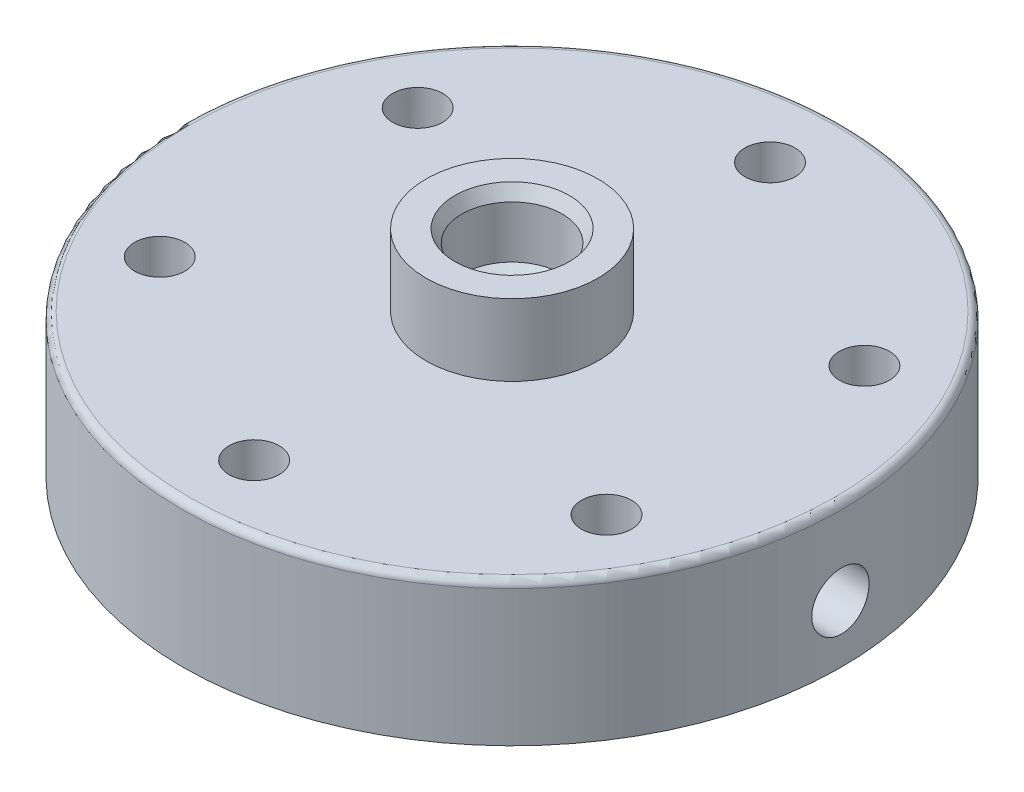
ISO-10303-21;
HEADER;
FILE_DESCRIPTION(('STEP AP214'),'2;1');
FILE_NAME('part.step','',(''),(''),'','','');
FILE_SCHEMA(('AUTOMOTIVE_DESIGN { 1 0 10303 214 1 1 1 1 }'));
ENDSEC;
DATA;
#1=APPLICATION_CONTEXT('core data for automotive mechanical design processes');
#2=APPLICATION_PROTOCOL_DEFINITION('international standard','automotive_design',2000,#1);
#3=PRODUCT_CONTEXT('',#1,'mechanical');
#4=PRODUCT('Part','Part','',(#3));
#5=PRODUCT_RELATED_PRODUCT_CATEGORY('part','',(#4));
#6=PRODUCT_DEFINITION_FORMATION('','',#4);
#7=PRODUCT_DEFINITION_CONTEXT('part definition',#1,'design');
#8=PRODUCT_DEFINITION('design','',#6,#7);
#9=PRODUCT_DEFINITION_SHAPE('','',#8);
#10=(LENGTH_UNIT() NAMED_UNIT(*) SI_UNIT(.MILLI.,.METRE.));
#11=(NAMED_UNIT(*) PLANE_ANGLE_UNIT() SI_UNIT($,.RADIAN.));
#12=(NAMED_UNIT(*) SI_UNIT($,.STERADIAN.) SOLID_ANGLE_UNIT());
#13=UNCERTAINTY_MEASURE_WITH_UNIT(LENGTH_MEASURE(1.E-05),#10,'distance_accuracy_value','');
#14=(GEOMETRIC_REPRESENTATION_CONTEXT(3) GLOBAL_UNCERTAINTY_ASSIGNED_CONTEXT((#13)) GLOBAL_UNIT_ASSIGNED_CONTEXT((#10,
#11,#12)) REPRESENTATION_CONTEXT('',''));
#15=CARTESIAN_POINT('',(0.,0.,0.));
#16=DIRECTION('',(0.,0.,1.));
#17=DIRECTION('',(1.,0.,0.));
#18=AXIS2_PLACEMENT_3D('',#15,#16,#17);
#19=CARTESIAN_POINT('',(0.,20.,0.));
#20=DIRECTION('',(0.,-1.,0.));
#21=DIRECTION('',(0.,0.,-1.));
#22=AXIS2_PLACEMENT_3D('',#19,#20,#21);
#23=CYLINDRICAL_SURFACE('',#22,46.);
#24=CARTESIAN_POINT('',(0.,19.,0.));
#25=DIRECTION('',(0.,1.,0.));
#26=DIRECTION('',(0.,0.,1.));
#27=AXIS2_PLACEMENT_3D('',#24,#25,#26);
#28=CIRCLE('',#27,46.);
#29=CARTESIAN_POINT('',(0.,19.,46.));
#30=VERTEX_POINT('',#29);
#31=EDGE_CURVE('E193',#30,#30,#28,.F.);
#32=ORIENTED_EDGE('',*,*,#31,.T.);
#33=EDGE_LOOP('',(#32));
#34=FACE_BOUND('',#33,.T.);
#35=CARTESIAN_POINT('',(0.,0.,0.));
#36=DIRECTION('',(0.,1.,0.));
#37=DIRECTION('',(0.,0.,1.));
#38=AXIS2_PLACEMENT_3D('',#35,#36,#37);
#39=CIRCLE('',#38,46.);
#40=CARTESIAN_POINT('',(0.,0.,46.));
#41=VERTEX_POINT('',#40);
#42=EDGE_CURVE('E180',#41,#41,#39,.T.);
#43=ORIENTED_EDGE('',*,*,#42,.T.);
#44=EDGE_LOOP('',(#43));
#45=FACE_BOUND('',#44,.T.);
#46=CARTESIAN_POINT('',(46.,4.,0.));
#47=CARTESIAN_POINT('',(45.9999977285705,4.00000977767558,-0.224227383894109));
#48=CARTESIAN_POINT('',(45.9983430362557,4.01891765184624,-0.448606525183141));
#49=CARTESIAN_POINT('',(45.9919012379841,4.094065072974,-0.891154156323271));
#50=CARTESIAN_POINT('',(45.9871106030481,4.15034667884991,-1.10931535995352));
#51=CARTESIAN_POINT('',(45.9749381658736,4.29859949987995,-1.53295378380859));
#52=CARTESIAN_POINT('',(45.9675578500262,4.39055024531742,-1.73843820070689));
#53=CARTESIAN_POINT('',(45.9510332255131,4.60749393271544,-2.13100809888229));
#54=CARTESIAN_POINT('',(45.9418892889027,4.73247990758485,-2.31809744825638));
#55=CARTESIAN_POINT('',(45.9228348976703,5.0123182801845,-2.66913129878992));
#56=CARTESIAN_POINT('',(45.9129226200477,5.16724309709402,-2.83301797480505));
#57=CARTESIAN_POINT('',(45.8934639727461,5.50240802458864,-3.13249799915954));
#58=CARTESIAN_POINT('',(45.883917619324,5.68264925824924,-3.26809009164363));
#59=CARTESIAN_POINT('',(45.8662523263715,6.06368350351458,-3.50732983244712));
#60=CARTESIAN_POINT('',(45.8581356821084,6.2645087579517,-3.61092631199781));
#61=CARTESIAN_POINT('',(45.8442700926442,6.68078588519783,-3.78290727978104));
#62=CARTESIAN_POINT('',(45.8385211022726,6.89623747887064,-3.85129243978993));
#63=CARTESIAN_POINT('',(45.830057344427,7.33506953277857,-3.95074097738121));
#64=CARTESIAN_POINT('',(45.8273348860433,7.55842840039361,-3.98189897039565));
#65=CARTESIAN_POINT('',(45.8252082353394,8.00722090759731,-4.00630104440279));
#66=CARTESIAN_POINT('',(45.8258039757165,8.23265450501178,-3.99954589438519));
#67=CARTESIAN_POINT('',(45.8302394140666,8.67854807492503,-3.9483915880778));
#68=CARTESIAN_POINT('',(45.8340702424775,8.8990199557931,-3.90409535607296));
#69=CARTESIAN_POINT('',(45.8445303189289,9.32938773230792,-3.77927624600677));
#70=CARTESIAN_POINT('',(45.8511595964273,9.53928351659897,-3.69875298659973));
#71=CARTESIAN_POINT('',(45.866479827065,9.94286835048831,-3.50365067255338));
#72=CARTESIAN_POINT('',(45.8751735661868,10.136535016963,-3.38902554426596));
#73=CARTESIAN_POINT('',(45.8936406284605,10.5019193213975,-3.12900647092458));
#74=CARTESIAN_POINT('',(45.9034139754438,10.6736364746627,-2.98361184659911));
#75=CARTESIAN_POINT('',(45.9229785147518,10.9908457111766,-2.66560421524801));
#76=CARTESIAN_POINT('',(45.9327696582409,11.1362486274573,-2.4929022472207));
#77=CARTESIAN_POINT('',(45.95123564835,11.3960121724796,-2.12549237013379));
#78=CARTESIAN_POINT('',(45.959910494134,11.5103727779739,-1.93078444459427));
#79=CARTESIAN_POINT('',(45.9751683502548,11.704800271593,-1.52483096588586));
#80=CARTESIAN_POINT('',(45.9817511125928,11.7848630943976,-1.31358345578605));
#81=CARTESIAN_POINT('',(45.9920803344126,11.9083593146094,-0.880574461427625));
#82=CARTESIAN_POINT('',(45.995826857993,11.9517935398213,-0.658813214898612));
#83=CARTESIAN_POINT('',(46.0000532442106,12.0006875643246,-0.211844479152891));
#84=CARTESIAN_POINT('',(46.0005436994455,12.006270502174,0.0133494440173113));
#85=CARTESIAN_POINT('',(45.9982310016282,11.9796262226001,0.461469996673724));
#86=CARTESIAN_POINT('',(45.9954278820702,11.9473993896855,0.684396649193819));
#87=CARTESIAN_POINT('',(45.9868500316988,11.8461524512686,1.12130261089923));
#88=CARTESIAN_POINT('',(45.9810799206281,11.777189539549,1.33529527230571));
#89=CARTESIAN_POINT('',(45.967216103292,11.6044865363973,1.74867267660003));
#90=CARTESIAN_POINT('',(45.9591223571432,11.5007458480247,1.94805716867549));
#91=CARTESIAN_POINT('',(45.9414917704405,11.261123482931,2.32711808841676));
#92=CARTESIAN_POINT('',(45.9319512956969,11.1251603650181,2.50674286157891));
#93=CARTESIAN_POINT('',(45.9125109361372,10.8250701030327,2.84066374135941));
#94=CARTESIAN_POINT('',(45.9026110445232,10.6609424260434,2.99495936860324));
#95=CARTESIAN_POINT('',(45.8835361672919,10.3086470829359,3.27426550151283));
#96=CARTESIAN_POINT('',(45.8743632176725,10.1204155095944,3.39919555788598));
#97=CARTESIAN_POINT('',(45.8578101371487,9.7255730943939,3.61567234236893));
#98=CARTESIAN_POINT('',(45.8504299869865,9.51896244999095,3.70721942907557));
#99=CARTESIAN_POINT('',(45.8383098416306,9.09350985635044,3.85419502490978));
#100=CARTESIAN_POINT('',(45.8335662683104,8.87468492952759,3.90967250193944));
#101=CARTESIAN_POINT('',(45.8272445862578,8.43078296645951,3.98309339935581));
#102=CARTESIAN_POINT('',(45.825666410717,8.20570606226926,4.00103761191455));
#103=CARTESIAN_POINT('',(45.8258552825946,7.7564887632843,3.99887309501891));
#104=CARTESIAN_POINT('',(45.8276112185648,7.53234774397545,3.97889076180226));
#105=CARTESIAN_POINT('',(45.834246839158,7.09061829859628,3.90170423350695));
#106=CARTESIAN_POINT('',(45.8391265283207,6.87302988204917,3.84449998433456));
#107=CARTESIAN_POINT('',(45.8514568827458,6.45057585402429,3.69452606310882));
#108=CARTESIAN_POINT('',(45.8589073615243,6.24570932097893,3.6017589707124));
#109=CARTESIAN_POINT('',(45.8755401471554,5.85443688157736,3.38330655214035));
#110=CARTESIAN_POINT('',(45.8847224303796,5.66803072340356,3.25762167508082));
#111=CARTESIAN_POINT('',(45.9038206784499,5.31832322639036,2.97642627183586));
#112=CARTESIAN_POINT('',(45.9137388879215,5.15509740320765,2.82082198308656));
#113=CARTESIAN_POINT('',(45.93317092391,4.85701131433315,2.48437904881077));
#114=CARTESIAN_POINT('',(45.9426846522082,4.72215790716712,2.303534319391));
#115=CARTESIAN_POINT('',(45.9602544666636,4.48444685001922,1.92136583977714));
#116=CARTESIAN_POINT('',(45.9683076119567,4.38165345959633,1.72000201971635));
#117=CARTESIAN_POINT('',(45.9820150223571,4.21146917389082,1.30293824908928));
#118=CARTESIAN_POINT('',(45.9876720328809,4.1440377407665,1.08725503492918));
#119=CARTESIAN_POINT('',(45.994503746574,4.06359259940162,0.725257992711601));
#120=CARTESIAN_POINT('',(45.9965554127388,4.03977724903366,0.581269530602114));
#121=CARTESIAN_POINT('',(45.9993042759584,4.00797779362126,0.291542097632155));
#122=CARTESIAN_POINT('',(46.0000014769897,3.99999364209805,0.145803131912245));
#123=CARTESIAN_POINT('',(46.,4.,0.));
#124=B_SPLINE_CURVE_WITH_KNOTS('',3,(#46,#47,#48,#49,#50,#51,#52,#53,#54,#55,#56,#57,#58,#59,
#60,#61,#62,#63,#64,#65,#66,#67,#68,#69,#70,#71,#72,#73,#74,#75,#76,#77,#78,#79,#80,#81,#82,#83,
#84,#85,#86,#87,#88,#89,#90,#91,#92,#93,#94,#95,#96,#97,#98,#99,#100,#101,#102,#103,#104,#105,
#106,#107,#108,#109,#110,#111,#112,#113,#114,#115,#116,#117,#118,#119,#120,#121,#122,#123),
.UNSPECIFIED.,.T.,.F.,(4,2,2,2,2,2,2,2,2,2,2,2,2,2,2,2,2,2,2,2,2,2,2,2,2,2,2,2,2,2,2,2,2,2,2,2,
2,2,4),(0.,0.672149795371173,1.34505728632151,2.01757918073403,2.68995935408334,
3.36398678235651,4.03804412098098,4.71317392514569,5.38829084842311,6.06168824011353,
6.73507197338011,7.40661547829384,8.07816605241073,8.75062808366532,9.42310496183092,
10.0978195498406,10.7725346431367,11.4473296883784,12.1221094828746,12.7946930125715,
13.4672697024505,14.1388023163357,14.8103464572807,15.4836063550193,16.1568789932759,
16.8319751599037,17.507064074496,18.1812345677475,18.855390831904,19.5273043074988,
20.1992187595716,20.8710844815444,21.5429410373477,22.2169384480893,22.8910985989687,
23.5666014469276,24.2413282173606,24.6783927333046,25.11545596607),.UNSPECIFIED.);
#125=CARTESIAN_POINT('',(46.,4.,0.));
#126=VERTEX_POINT('',#125);
#127=EDGE_CURVE('E249',#126,#126,#124,.T.);
#128=ORIENTED_EDGE('',*,*,#127,.F.);
#129=EDGE_LOOP('',(#128));
#130=FACE_BOUND('',#129,.T.);
#131=ADVANCED_FACE('F45',(#34,#45,#130),#23,.T.);
#132=CARTESIAN_POINT('',(0.,14.,0.));
#133=DIRECTION('',(0.,-1.,0.));
#134=DIRECTION('',(0.,0.,-1.));
#135=AXIS2_PLACEMENT_3D('',#132,#133,#134);
#136=CYLINDRICAL_SURFACE('',#135,33.);
#137=DIRECTION('',(0.,-1.,0.));
#138=VECTOR('',#137,1.);
#139=CARTESIAN_POINT('',(29.4024648652404,7.,-14.9831592078675));
#140=LINE('',#139,#138);
#141=CARTESIAN_POINT('',(29.4024648652404,14.,-14.9831592078675));
#142=VERTEX_POINT('',#141);
#143=CARTESIAN_POINT('',(29.4024648652404,0.,-14.9831592078675));
#144=VERTEX_POINT('',#143);
#145=EDGE_CURVE('E302',#142,#144,#140,.T.);
#146=ORIENTED_EDGE('',*,*,#145,.T.);
#147=CARTESIAN_POINT('',(0.,0.,0.));
#148=DIRECTION('',(0.,-1.,0.));
#149=DIRECTION('',(0.,0.,-1.));
#150=AXIS2_PLACEMENT_3D('',#147,#148,#149);
#151=CIRCLE('',#150,33.);
#152=CARTESIAN_POINT('',(29.4024648652422,0.,14.9831592078639));
#153=VERTEX_POINT('',#152);
#154=EDGE_CURVE('E168',#144,#153,#151,.T.);
#155=ORIENTED_EDGE('',*,*,#154,.T.);
#156=DIRECTION('',(0.,-1.,0.));
#157=VECTOR('',#156,1.);
#158=CARTESIAN_POINT('',(29.4024648652422,7.,14.9831592078639));
#159=LINE('',#158,#157);
#160=CARTESIAN_POINT('',(29.4024648652422,14.,14.9831592078639));
#161=VERTEX_POINT('',#160);
#162=EDGE_CURVE('E299',#153,#161,#159,.F.);
#163=ORIENTED_EDGE('',*,*,#162,.T.);
#164=CARTESIAN_POINT('',(0.,14.,0.));
#165=DIRECTION('',(0.,-1.,0.));
#166=DIRECTION('',(0.,0.,-1.));
#167=AXIS2_PLACEMENT_3D('',#164,#165,#166);
#168=CIRCLE('',#167,33.);
#169=EDGE_CURVE('E264',#142,#161,#168,.T.);
#170=ORIENTED_EDGE('',*,*,#169,.F.);
#171=EDGE_LOOP('',(#146,#155,#163,#170));
#172=FACE_BOUND('',#171,.T.);
#173=CARTESIAN_POINT('',(32.7566787083184,8.,4.));
#174=CARTESIAN_POINT('',(32.7566818366577,8.22379449651927,3.99999045298508));
#175=CARTESIAN_POINT('',(32.7589969177124,8.44773021035809,3.98115515343243));
#176=CARTESIAN_POINT('',(32.7680039727008,8.889373365523,3.90631302023377));
#177=CARTESIAN_POINT('',(32.7747005616006,9.10707398689689,3.85026699225597));
#178=CARTESIAN_POINT('',(32.7917012296198,9.52978851419071,3.70267655289125));
#179=CARTESIAN_POINT('',(32.8020029032309,9.73481077272732,3.61115580778966));
#180=CARTESIAN_POINT('',(32.8250500965597,10.126547201995,3.39526371924446));
#181=CARTESIAN_POINT('',(32.8377951872424,10.3132645781591,3.27089814151645));
#182=CARTESIAN_POINT('',(32.864368406131,10.6641144539865,2.99214417405283));
#183=CARTESIAN_POINT('',(32.8782013482531,10.8281365492641,2.83761726919589));
#184=CARTESIAN_POINT('',(32.905348295857,11.127986665219,2.50322501027308));
#185=CARTESIAN_POINT('',(32.9186622758482,11.2638133023978,2.32335841356232));
#186=CARTESIAN_POINT('',(32.9433202079721,11.5038108864133,1.94270104483964));
#187=CARTESIAN_POINT('',(32.9546579142429,11.6078822238784,1.74184703190994));
#188=CARTESIAN_POINT('',(32.9740330113373,11.7807771367326,1.325352481192));
#189=CARTESIAN_POINT('',(32.9820705176523,11.8496019456042,1.10971246115218));
#190=CARTESIAN_POINT('',(32.993905717215,11.9497211000787,0.670894532630864));
#191=CARTESIAN_POINT('',(32.9977241084167,11.9811987186027,0.447759006205902));
#192=CARTESIAN_POINT('',(33.0007614848467,12.0062977980333,-0.000657902440336723));
#193=CARTESIAN_POINT('',(32.9999806408196,11.9999206642805,-0.225939204690659));
#194=CARTESIAN_POINT('',(32.9939243045577,11.949638451385,-0.671006287963217));
#195=CARTESIAN_POINT('',(32.9886724189773,11.9059304714488,-0.890814702972183));
#196=CARTESIAN_POINT('',(32.974290708158,11.7825352080508,-1.31995337515371));
#197=CARTESIAN_POINT('',(32.9651608129403,11.7028472753272,-1.52928344316775));
#198=CARTESIAN_POINT('',(32.9440083562255,11.5095434798085,-1.93213533023985));
#199=CARTESIAN_POINT('',(32.931978510434,11.3958420033639,-2.12561567058178));
#200=CARTESIAN_POINT('',(32.9063727008439,11.1378009464467,-2.49082341217299));
#201=CARTESIAN_POINT('',(32.8927966703688,10.9934600444738,-2.66254987465172));
#202=CARTESIAN_POINT('',(32.8655155228159,10.6771327598167,-2.98053255244169));
#203=CARTESIAN_POINT('',(32.8518101368879,10.5049746541673,-3.12661796887099));
#204=CARTESIAN_POINT('',(32.8259012315593,10.1384907062635,-3.38784512845958));
#205=CARTESIAN_POINT('',(32.8136977163744,9.9441648017874,-3.50298678476122));
#206=CARTESIAN_POINT('',(32.7921742461928,9.5387127347217,-3.69906598308285));
#207=CARTESIAN_POINT('',(32.7828554012633,9.32758014384369,-3.77999036212115));
#208=CARTESIAN_POINT('',(32.7681782798095,8.89458469521924,-3.90518910413138));
#209=CARTESIAN_POINT('',(32.762819824179,8.67272232320457,-3.94946512451534));
#210=CARTESIAN_POINT('',(32.7567026814491,8.22607215318564,-3.99988519584663));
#211=CARTESIAN_POINT('',(32.7559150285832,8.00131184385607,-4.00626937814872));
#212=CARTESIAN_POINT('',(32.7589520971464,7.55392484932071,-3.98135765376567));
#213=CARTESIAN_POINT('',(32.7627767262732,7.33129812150695,-3.95006250113017));
#214=CARTESIAN_POINT('',(32.7745810041736,6.89521419985763,-3.85088243715065));
#215=CARTESIAN_POINT('',(32.7825474977128,6.68173027716842,-3.78311334910617));
#216=CARTESIAN_POINT('',(32.8017272208065,6.26915668890473,-3.6130281927127));
#217=CARTESIAN_POINT('',(32.8129405579643,6.07006750065879,-3.51071097938724));
#218=CARTESIAN_POINT('',(32.8374200222184,5.69084701770273,-3.27384173326402));
#219=CARTESIAN_POINT('',(32.8506960788503,5.51081490615677,-3.13913195401655));
#220=CARTESIAN_POINT('',(32.8777737228222,5.17582999170711,-2.84152499642419));
#221=CARTESIAN_POINT('',(32.8915753293471,5.02087810543773,-2.67862678829609));
#222=CARTESIAN_POINT('',(32.9182377149735,4.73961116971855,-2.32821925622029));
#223=CARTESIAN_POINT('',(32.931093067008,4.61345372359441,-2.1405829546922));
#224=CARTESIAN_POINT('',(32.9543337105298,4.39444633148219,-1.74664463837715));
#225=CARTESIAN_POINT('',(32.9647190492445,4.30159574863799,-1.54034298058246));
#226=CARTESIAN_POINT('',(32.9818253693875,4.15209915484651,-1.11545816602638));
#227=CARTESIAN_POINT('',(32.98855563168,4.09536138361741,-0.896907684380683));
#228=CARTESIAN_POINT('',(32.9976319498885,4.0194023139405,-0.453295431839336));
#229=CARTESIAN_POINT('',(32.9999781911159,4.00017942974683,-0.228233936570891));
#230=CARTESIAN_POINT('',(33.000021367475,3.99982420871652,0.220471313794806));
#231=CARTESIAN_POINT('',(32.9977479977708,4.01844858720769,0.444114912587442));
#232=CARTESIAN_POINT('',(32.9888663257534,4.0927447933209,0.885069092955427));
#233=CARTESIAN_POINT('',(32.9822580252319,4.14841660563101,1.10237967714821));
#234=CARTESIAN_POINT('',(32.9654458725196,4.29515239763123,1.5244721638081));
#235=CARTESIAN_POINT('',(32.9552431301393,4.38620545399445,1.72925791053233));
#236=CARTESIAN_POINT('',(32.9323730883384,4.60109385860996,2.12068092912073));
#237=CARTESIAN_POINT('',(32.9197057667317,4.72492950197568,2.30731803758764));
#238=CARTESIAN_POINT('',(32.8932241859913,5.0027703589899,2.65838965314681));
#239=CARTESIAN_POINT('',(32.8794033429218,5.15695670285065,2.82268032326465));
#240=CARTESIAN_POINT('',(32.8522257784064,5.49074781671624,3.12315293120787));
#241=CARTESIAN_POINT('',(32.8388691678779,5.67035860998341,3.25932818941034));
#242=CARTESIAN_POINT('',(32.8140805805222,6.05064490506674,3.50012370208704));
#243=CARTESIAN_POINT('',(32.8026557772711,6.25139461410864,3.60462743792878));
#244=CARTESIAN_POINT('',(32.7831085801835,6.66761744458094,3.77829295203558));
#245=CARTESIAN_POINT('',(32.7749825744407,6.88307415937034,3.84749340586574));
#246=CARTESIAN_POINT('',(32.7649388059801,7.2497201316593,3.93190579331955));
#247=CARTESIAN_POINT('',(32.7618565652437,7.39859108355957,3.9574047064634));
#248=CARTESIAN_POINT('',(32.7577254688871,7.69828663429389,3.99145496920686));
#249=CARTESIAN_POINT('',(32.7566765991008,7.84911121950999,4.00000643687607));
#250=CARTESIAN_POINT('',(32.7566787083184,8.,4.));
#251=B_SPLINE_CURVE_WITH_KNOTS('',3,(#173,#174,#175,#176,#177,#178,#179,#180,#181,#182,#183,
#184,#185,#186,#187,#188,#189,#190,#191,#192,#193,#194,#195,#196,#197,#198,#199,#200,#201,#202,
#203,#204,#205,#206,#207,#208,#209,#210,#211,#212,#213,#214,#215,#216,#217,#218,#219,#220,#221,
#222,#223,#224,#225,#226,#227,#228,#229,#230,#231,#232,#233,#234,#235,#236,#237,#238,#239,#240,
#241,#242,#243,#244,#245,#246,#247,#248,#249,#250),.UNSPECIFIED.,.T.,.F.,(4,2,2,2,2,2,2,2,2,2,2,
2,2,2,2,2,2,2,2,2,2,2,2,2,2,2,2,2,2,2,2,2,2,2,2,2,2,2,4),(0.,0.67083230252087,1.34237232097104,
2.01346510316178,2.68444015720846,3.35857240178021,4.03273771695039,4.70899650098513,
5.38523161715035,6.05813435270303,6.73101210720266,7.40035901245526,8.06971799662072,
8.74077617066324,9.41186329380664,10.087263693043,10.762665988076,11.4383278665181,
12.1139591866663,12.7853042281999,13.4566358348076,14.1258480927268,14.7950825315168,
15.467644495884,16.140231035558,16.8164150504307,17.4925861353889,18.1670321819991,
18.8414497193086,19.5115457711023,20.1816415459413,20.8515306048434,21.5214256943855,
22.1954469793233,22.8696282135606,23.5462604462507,24.2221498121776,24.6744476783457,
25.1267423934303),.UNSPECIFIED.);
#252=CARTESIAN_POINT('',(32.7566787083184,8.,4.));
#253=VERTEX_POINT('',#252);
#254=EDGE_CURVE('E50',#253,#253,#251,.T.);
#255=ORIENTED_EDGE('',*,*,#254,.F.);
#256=EDGE_LOOP('',(#255));
#257=FACE_BOUND('',#256,.T.);
#258=ADVANCED_FACE('F404',(#172,#257),#136,.F.);
#259=CARTESIAN_POINT('',(0.,20.,0.));
#260=DIRECTION('',(0.,1.,0.));
#261=DIRECTION('',(0.,0.,1.));
#262=AXIS2_PLACEMENT_3D('',#259,#260,#261);
#263=PLANE('',#262);
#264=CARTESIAN_POINT('',(0.,20.,0.));
#265=DIRECTION('',(0.,1.,0.));
#266=DIRECTION('',(0.,0.,1.));
#267=AXIS2_PLACEMENT_3D('',#264,#265,#266);
#268=CIRCLE('',#267,12.);
#269=CARTESIAN_POINT('',(0.,20.,12.));
#270=VERTEX_POINT('',#269);
#271=EDGE_CURVE('E309',#270,#270,#268,.T.);
#272=ORIENTED_EDGE('',*,*,#271,.F.);
#273=EDGE_LOOP('',(#272));
#274=FACE_BOUND('',#273,.T.);
#275=CARTESIAN_POINT('',(0.,20.,0.));
#276=DIRECTION('',(0.,1.,0.));
#277=DIRECTION('',(0.,0.,1.));
#278=AXIS2_PLACEMENT_3D('',#275,#276,#277);
#279=CIRCLE('',#278,45.);
#280=CARTESIAN_POINT('',(0.,20.,45.));
#281=VERTEX_POINT('',#280);
#282=EDGE_CURVE('E189',#281,#281,#279,.T.);
#283=ORIENTED_EDGE('',*,*,#282,.T.);
#284=EDGE_LOOP('',(#283));
#285=FACE_BOUND('',#284,.T.);
#286=CARTESIAN_POINT('',(-31.1769145362365,20.,18.0000000000019));
#287=DIRECTION('',(0.,1.,0.));
#288=DIRECTION('',(0.,0.,1.));
#289=AXIS2_PLACEMENT_3D('',#286,#287,#288);
#290=CIRCLE('',#289,3.5);
#291=CARTESIAN_POINT('',(-31.1769145362365,20.,21.5000000000019));
#292=VERTEX_POINT('',#291);
#293=EDGE_CURVE('E326',#292,#292,#290,.T.);
#294=ORIENTED_EDGE('',*,*,#293,.F.);
#295=EDGE_LOOP('',(#294));
#296=FACE_BOUND('',#295,.T.);
#297=CARTESIAN_POINT('',(31.1769145362431,20.,17.9999999999981));
#298=DIRECTION('',(0.,1.,0.));
#299=DIRECTION('',(0.,0.,1.));
#300=AXIS2_PLACEMENT_3D('',#297,#298,#299);
#301=CIRCLE('',#300,3.5);
#302=CARTESIAN_POINT('',(31.1769145362431,20.,21.4999999999981));
#303=VERTEX_POINT('',#302);
#304=EDGE_CURVE('E341',#303,#303,#301,.T.);
#305=ORIENTED_EDGE('',*,*,#304,.F.);
#306=EDGE_LOOP('',(#305));
#307=FACE_BOUND('',#306,.T.);
#308=CARTESIAN_POINT('',(0.,20.,-36.));
#309=DIRECTION('',(0.,1.,0.));
#310=DIRECTION('',(0.,0.,1.));
#311=AXIS2_PLACEMENT_3D('',#308,#309,#310);
#312=CIRCLE('',#311,3.5);
#313=CARTESIAN_POINT('',(0.,20.,-32.5));
#314=VERTEX_POINT('',#313);
#315=EDGE_CURVE('E174',#314,#314,#312,.T.);
#316=ORIENTED_EDGE('',*,*,#315,.F.);
#317=EDGE_LOOP('',(#316));
#318=FACE_BOUND('',#317,.T.);
#319=CARTESIAN_POINT('',(31.1769145362409,20.,-18.0000000000019));
#320=DIRECTION('',(0.,1.,0.));
#321=DIRECTION('',(0.,0.,1.));
#322=AXIS2_PLACEMENT_3D('',#319,#320,#321);
#323=CIRCLE('',#322,3.5);
#324=CARTESIAN_POINT('',(31.1769145362409,20.,-14.5000000000019));
#325=VERTEX_POINT('',#324);
#326=EDGE_CURVE('E175',#325,#325,#323,.T.);
#327=ORIENTED_EDGE('',*,*,#326,.F.);
#328=EDGE_LOOP('',(#327));
#329=FACE_BOUND('',#328,.T.);
#330=CARTESIAN_POINT('',(4.41909090955326E-12,20.,36.));
#331=DIRECTION('',(0.,1.,0.));
#332=DIRECTION('',(0.,0.,1.));
#333=AXIS2_PLACEMENT_3D('',#330,#331,#332);
#334=CIRCLE('',#333,3.5);
#335=CARTESIAN_POINT('',(4.41909090955326E-12,20.,39.5));
#336=VERTEX_POINT('',#335);
#337=EDGE_CURVE('E334',#336,#336,#334,.T.);
#338=ORIENTED_EDGE('',*,*,#337,.F.);
#339=EDGE_LOOP('',(#338));
#340=FACE_BOUND('',#339,.T.);
#341=CARTESIAN_POINT('',(-31.1769145362387,20.,-17.9999999999981));
#342=DIRECTION('',(0.,1.,0.));
#343=DIRECTION('',(0.,0.,1.));
#344=AXIS2_PLACEMENT_3D('',#341,#342,#343);
#345=CIRCLE('',#344,3.5);
#346=CARTESIAN_POINT('',(-31.1769145362387,20.,-14.4999999999981));
#347=VERTEX_POINT('',#346);
#348=EDGE_CURVE('E318',#347,#347,#345,.T.);
#349=ORIENTED_EDGE('',*,*,#348,.F.);
#350=EDGE_LOOP('',(#349));
#351=FACE_BOUND('',#350,.T.);
#352=ADVANCED_FACE('F414',(#274,#285,#296,#307,#318,#329,#340,#351),#263,.T.);
#353=CARTESIAN_POINT('',(0.,0.,0.));
#354=DIRECTION('',(0.,1.,0.));
#355=DIRECTION('',(0.,0.,1.));
#356=AXIS2_PLACEMENT_3D('',#353,#354,#355);
#357=PLANE('',#356);
#358=ORIENTED_EDGE('',*,*,#42,.F.);
#359=EDGE_LOOP('',(#358));
#360=FACE_BOUND('',#359,.T.);
#361=CARTESIAN_POINT('',(4.41909090955326E-12,0.,36.));
#362=DIRECTION('',(0.,1.,0.));
#363=DIRECTION('',(0.,0.,1.));
#364=AXIS2_PLACEMENT_3D('',#361,#362,#363);
#365=CIRCLE('',#364,3.5);
#366=CARTESIAN_POINT('',(-1.7254359296602,0.,32.9548611111113));
#367=VERTEX_POINT('',#366);
#368=CARTESIAN_POINT('',(1.72543592966829,0.,32.9548611111109));
#369=VERTEX_POINT('',#368);
#370=EDGE_CURVE('E330',#367,#369,#365,.T.);
#371=ORIENTED_EDGE('',*,*,#370,.T.);
#372=CARTESIAN_POINT('',(27.6770289355813,0.,17.9717019032421));
#373=VERTEX_POINT('',#372);
#374=EDGE_CURVE('E360',#373,#369,#151,.T.);
#375=ORIENTED_EDGE('',*,*,#374,.F.);
#376=CARTESIAN_POINT('',(31.1769145362431,0.,17.9999999999981));
#377=DIRECTION('',(0.,1.,0.));
#378=DIRECTION('',(0.,0.,1.));
#379=AXIS2_PLACEMENT_3D('',#376,#377,#378);
#380=CIRCLE('',#379,3.5);
#381=EDGE_CURVE('E338',#373,#153,#380,.T.);
#382=ORIENTED_EDGE('',*,*,#381,.T.);
#383=ORIENTED_EDGE('',*,*,#154,.F.);
#384=CARTESIAN_POINT('',(31.1769145362409,0.,-18.0000000000019));
#385=DIRECTION('',(0.,1.,0.));
#386=DIRECTION('',(0.,0.,1.));
#387=AXIS2_PLACEMENT_3D('',#384,#385,#386);
#388=CIRCLE('',#387,3.5);
#389=CARTESIAN_POINT('',(27.6770289355791,0.,-17.9717019032455));
#390=VERTEX_POINT('',#389);
#391=EDGE_CURVE('E165',#144,#390,#388,.T.);
#392=ORIENTED_EDGE('',*,*,#391,.T.);
#393=CARTESIAN_POINT('',(1.72543592966437,0.,-32.9548611111111));
#394=VERTEX_POINT('',#393);
#395=EDGE_CURVE('E146',#394,#390,#151,.T.);
#396=ORIENTED_EDGE('',*,*,#395,.F.);
#397=CARTESIAN_POINT('',(0.,0.,-36.));
#398=DIRECTION('',(0.,1.,0.));
#399=DIRECTION('',(0.,0.,1.));
#400=AXIS2_PLACEMENT_3D('',#397,#398,#399);
#401=CIRCLE('',#400,3.5);
#402=CARTESIAN_POINT('',(-1.72543592966437,0.,-32.9548611111111));
#403=VERTEX_POINT('',#402);
#404=EDGE_CURVE('E162',#394,#403,#401,.T.);
#405=ORIENTED_EDGE('',*,*,#404,.T.);
#406=CARTESIAN_POINT('',(-27.6770289355769,0.,-17.9717019032489));
#407=VERTEX_POINT('',#406);
#408=EDGE_CURVE('E170',#407,#403,#151,.T.);
#409=ORIENTED_EDGE('',*,*,#408,.F.);
#410=CARTESIAN_POINT('',(-31.1769145362387,0.,-17.9999999999981));
#411=DIRECTION('',(0.,1.,0.));
#412=DIRECTION('',(0.,0.,1.));
#413=AXIS2_PLACEMENT_3D('',#410,#411,#412);
#414=CIRCLE('',#413,3.5);
#415=CARTESIAN_POINT('',(-29.4024648652441,0.,-14.9831592078602));
#416=VERTEX_POINT('',#415);
#417=EDGE_CURVE('E314',#407,#416,#414,.T.);
#418=ORIENTED_EDGE('',*,*,#417,.T.);
#419=CARTESIAN_POINT('',(-29.4024648652422,0.,14.9831592078639));
#420=VERTEX_POINT('',#419);
#421=EDGE_CURVE('E364',#420,#416,#151,.T.);
#422=ORIENTED_EDGE('',*,*,#421,.F.);
#423=CARTESIAN_POINT('',(-31.1769145362365,0.,18.0000000000019));
#424=DIRECTION('',(0.,1.,0.));
#425=DIRECTION('',(0.,0.,1.));
#426=AXIS2_PLACEMENT_3D('',#423,#424,#425);
#427=CIRCLE('',#426,3.5);
#428=CARTESIAN_POINT('',(-27.6770289355746,0.,17.9717019032524));
#429=VERTEX_POINT('',#428);
#430=EDGE_CURVE('E322',#420,#429,#427,.T.);
#431=ORIENTED_EDGE('',*,*,#430,.T.);
#432=EDGE_CURVE('E362',#367,#429,#151,.T.);
#433=ORIENTED_EDGE('',*,*,#432,.F.);
#434=EDGE_LOOP('',(#371,#375,#382,#383,#392,#396,#405,#409,#418,#422,#431,#433));
#435=FACE_BOUND('',#434,.T.);
#436=ADVANCED_FACE('F160',(#360,#435),#357,.F.);
#437=CARTESIAN_POINT('',(0.,20.,-36.));
#438=DIRECTION('',(0.,-1.,0.));
#439=DIRECTION('',(0.,0.,-1.));
#440=AXIS2_PLACEMENT_3D('',#437,#438,#439);
#441=CYLINDRICAL_SURFACE('',#440,3.5);
#442=DIRECTION('',(0.,-1.,0.));
#443=VECTOR('',#442,1.);
#444=CARTESIAN_POINT('',(-1.72543592966432,7.,-32.9548611111111));
#445=LINE('',#444,#443);
#446=CARTESIAN_POINT('',(-1.72543592966437,14.,-32.9548611111111));
#447=VERTEX_POINT('',#446);
#448=EDGE_CURVE('E76',#403,#447,#445,.F.);
#449=ORIENTED_EDGE('',*,*,#448,.F.);
#450=ORIENTED_EDGE('',*,*,#404,.F.);
#451=DIRECTION('',(0.,-1.,0.));
#452=VECTOR('',#451,1.);
#453=CARTESIAN_POINT('',(1.72543592966432,7.,-32.9548611111111));
#454=LINE('',#453,#452);
#455=CARTESIAN_POINT('',(1.72543592966437,14.,-32.9548611111111));
#456=VERTEX_POINT('',#455);
#457=EDGE_CURVE('E143',#456,#394,#454,.T.);
#458=ORIENTED_EDGE('',*,*,#457,.F.);
#459=CARTESIAN_POINT('',(0.,14.,-36.));
#460=DIRECTION('',(0.,-1.,0.));
#461=DIRECTION('',(0.,0.,-1.));
#462=AXIS2_PLACEMENT_3D('',#459,#460,#461);
#463=CIRCLE('',#462,3.5);
#464=EDGE_CURVE('E281',#456,#447,#463,.T.);
#465=ORIENTED_EDGE('',*,*,#464,.T.);
#466=EDGE_LOOP('',(#449,#450,#458,#465));
#467=FACE_BOUND('',#466,.T.);
#468=ORIENTED_EDGE('',*,*,#315,.T.);
#469=EDGE_LOOP('',(#468));
#470=FACE_BOUND('',#469,.T.);
#471=ADVANCED_FACE('F171',(#467,#470),#441,.F.);
#472=CARTESIAN_POINT('',(31.1769145362409,20.,-18.0000000000019));
#473=DIRECTION('',(0.,-1.,0.));
#474=DIRECTION('',(0.,0.,-1.));
#475=AXIS2_PLACEMENT_3D('',#472,#473,#474);
#476=CYLINDRICAL_SURFACE('',#475,3.5);
#477=DIRECTION('',(0.,-1.,0.));
#478=VECTOR('',#477,1.);
#479=CARTESIAN_POINT('',(27.6770289355791,7.,-17.9717019032455));
#480=LINE('',#479,#478);
#481=CARTESIAN_POINT('',(27.6770289355791,14.,-17.9717019032455));
#482=VERTEX_POINT('',#481);
#483=EDGE_CURVE('E154',#390,#482,#480,.F.);
#484=ORIENTED_EDGE('',*,*,#483,.F.);
#485=ORIENTED_EDGE('',*,*,#391,.F.);
#486=ORIENTED_EDGE('',*,*,#145,.F.);
#487=CARTESIAN_POINT('',(31.1769145362409,14.,-18.0000000000019));
#488=DIRECTION('',(0.,-1.,0.));
#489=DIRECTION('',(0.,0.,-1.));
#490=AXIS2_PLACEMENT_3D('',#487,#488,#489);
#491=CIRCLE('',#490,3.5);
#492=EDGE_CURVE('E277',#142,#482,#491,.T.);
#493=ORIENTED_EDGE('',*,*,#492,.T.);
#494=EDGE_LOOP('',(#484,#485,#486,#493));
#495=FACE_BOUND('',#494,.T.);
#496=ORIENTED_EDGE('',*,*,#326,.T.);
#497=EDGE_LOOP('',(#496));
#498=FACE_BOUND('',#497,.T.);
#499=ADVANCED_FACE('F408',(#495,#498),#476,.F.);
#500=CARTESIAN_POINT('',(31.1769145362431,20.,17.9999999999981));
#501=DIRECTION('',(0.,-1.,0.));
#502=DIRECTION('',(0.,0.,-1.));
#503=AXIS2_PLACEMENT_3D('',#500,#501,#502);
#504=CYLINDRICAL_SURFACE('',#503,3.5);
#505=ORIENTED_EDGE('',*,*,#162,.F.);
#506=ORIENTED_EDGE('',*,*,#381,.F.);
#507=DIRECTION('',(0.,-1.,0.));
#508=VECTOR('',#507,1.);
#509=CARTESIAN_POINT('',(27.6770289355813,7.,17.9717019032421));
#510=LINE('',#509,#508);
#511=CARTESIAN_POINT('',(27.6770289355813,14.,17.9717019032421));
#512=VERTEX_POINT('',#511);
#513=EDGE_CURVE('E296',#512,#373,#510,.T.);
#514=ORIENTED_EDGE('',*,*,#513,.F.);
#515=CARTESIAN_POINT('',(31.1769145362431,14.,17.9999999999981));
#516=DIRECTION('',(0.,-1.,0.));
#517=DIRECTION('',(0.,0.,-1.));
#518=AXIS2_PLACEMENT_3D('',#515,#516,#517);
#519=CIRCLE('',#518,3.5);
#520=EDGE_CURVE('E273',#512,#161,#519,.T.);
#521=ORIENTED_EDGE('',*,*,#520,.T.);
#522=EDGE_LOOP('',(#505,#506,#514,#521));
#523=FACE_BOUND('',#522,.T.);
#524=ORIENTED_EDGE('',*,*,#304,.T.);
#525=EDGE_LOOP('',(#524));
#526=FACE_BOUND('',#525,.T.);
#527=ADVANCED_FACE('F400',(#523,#526),#504,.F.);
#528=CARTESIAN_POINT('',(4.41909090955326E-12,20.,36.));
#529=DIRECTION('',(0.,-1.,0.));
#530=DIRECTION('',(0.,0.,-1.));
#531=AXIS2_PLACEMENT_3D('',#528,#529,#530);
#532=CYLINDRICAL_SURFACE('',#531,3.5);
#533=DIRECTION('',(0.,-1.,0.));
#534=VECTOR('',#533,1.);
#535=CARTESIAN_POINT('',(1.72543592966837,7.,32.9548611111109));
#536=LINE('',#535,#534);
#537=CARTESIAN_POINT('',(1.72543592966829,14.,32.9548611111109));
#538=VERTEX_POINT('',#537);
#539=EDGE_CURVE('E293',#369,#538,#536,.F.);
#540=ORIENTED_EDGE('',*,*,#539,.F.);
#541=ORIENTED_EDGE('',*,*,#370,.F.);
#542=DIRECTION('',(0.,-1.,0.));
#543=VECTOR('',#542,1.);
#544=CARTESIAN_POINT('',(-1.72543592966028,7.,32.9548611111113));
#545=LINE('',#544,#543);
#546=CARTESIAN_POINT('',(-1.7254359296602,14.,32.9548611111113));
#547=VERTEX_POINT('',#546);
#548=EDGE_CURVE('E290',#547,#367,#545,.T.);
#549=ORIENTED_EDGE('',*,*,#548,.F.);
#550=CARTESIAN_POINT('',(4.41909090955326E-12,14.,36.));
#551=DIRECTION('',(0.,-1.,0.));
#552=DIRECTION('',(0.,0.,-1.));
#553=AXIS2_PLACEMENT_3D('',#550,#551,#552);
#554=CIRCLE('',#553,3.5);
#555=EDGE_CURVE('E269',#547,#538,#554,.T.);
#556=ORIENTED_EDGE('',*,*,#555,.T.);
#557=EDGE_LOOP('',(#540,#541,#549,#556));
#558=FACE_BOUND('',#557,.T.);
#559=ORIENTED_EDGE('',*,*,#337,.T.);
#560=EDGE_LOOP('',(#559));
#561=FACE_BOUND('',#560,.T.);
#562=ADVANCED_FACE('F391',(#558,#561),#532,.F.);
#563=CARTESIAN_POINT('',(-31.1769145362365,20.,18.0000000000019));
#564=DIRECTION('',(0.,-1.,0.));
#565=DIRECTION('',(0.,0.,-1.));
#566=AXIS2_PLACEMENT_3D('',#563,#564,#565);
#567=CYLINDRICAL_SURFACE('',#566,3.5);
#568=DIRECTION('',(0.,-1.,0.));
#569=VECTOR('',#568,1.);
#570=CARTESIAN_POINT('',(-27.6770289355746,7.,17.9717019032524));
#571=LINE('',#570,#569);
#572=CARTESIAN_POINT('',(-27.6770289355746,14.,17.9717019032524));
#573=VERTEX_POINT('',#572);
#574=EDGE_CURVE('E287',#429,#573,#571,.F.);
#575=ORIENTED_EDGE('',*,*,#574,.F.);
#576=ORIENTED_EDGE('',*,*,#430,.F.);
#577=DIRECTION('',(0.,-1.,0.));
#578=VECTOR('',#577,1.);
#579=CARTESIAN_POINT('',(-29.4024648652423,7.,14.9831592078638));
#580=LINE('',#579,#578);
#581=CARTESIAN_POINT('',(-29.4024648652422,14.,14.9831592078639));
#582=VERTEX_POINT('',#581);
#583=EDGE_CURVE('E284',#582,#420,#580,.T.);
#584=ORIENTED_EDGE('',*,*,#583,.F.);
#585=CARTESIAN_POINT('',(-31.1769145362365,14.,18.0000000000019));
#586=DIRECTION('',(0.,-1.,0.));
#587=DIRECTION('',(0.,0.,-1.));
#588=AXIS2_PLACEMENT_3D('',#585,#586,#587);
#589=CIRCLE('',#588,3.5);
#590=EDGE_CURVE('E263',#582,#573,#589,.T.);
#591=ORIENTED_EDGE('',*,*,#590,.T.);
#592=EDGE_LOOP('',(#575,#576,#584,#591));
#593=FACE_BOUND('',#592,.T.);
#594=ORIENTED_EDGE('',*,*,#293,.T.);
#595=EDGE_LOOP('',(#594));
#596=FACE_BOUND('',#595,.T.);
#597=ADVANCED_FACE('F381',(#593,#596),#567,.F.);
#598=CARTESIAN_POINT('',(-31.1769145362387,20.,-17.9999999999981));
#599=DIRECTION('',(0.,-1.,0.));
#600=DIRECTION('',(0.,0.,-1.));
#601=AXIS2_PLACEMENT_3D('',#598,#599,#600);
#602=CYLINDRICAL_SURFACE('',#601,3.5);
#603=DIRECTION('',(0.,-1.,0.));
#604=VECTOR('',#603,1.);
#605=CARTESIAN_POINT('',(-29.4024648652441,7.,-14.9831592078602));
#606=LINE('',#605,#604);
#607=CARTESIAN_POINT('',(-29.4024648652441,14.,-14.9831592078602));
#608=VERTEX_POINT('',#607);
#609=EDGE_CURVE('E204',#416,#608,#606,.F.);
#610=ORIENTED_EDGE('',*,*,#609,.F.);
#611=ORIENTED_EDGE('',*,*,#417,.F.);
#612=DIRECTION('',(0.,-1.,0.));
#613=VECTOR('',#612,1.);
#614=CARTESIAN_POINT('',(-27.6770289355768,7.,-17.971701903249));
#615=LINE('',#614,#613);
#616=CARTESIAN_POINT('',(-27.6770289355769,14.,-17.9717019032489));
#617=VERTEX_POINT('',#616);
#618=EDGE_CURVE('E201',#617,#407,#615,.T.);
#619=ORIENTED_EDGE('',*,*,#618,.F.);
#620=CARTESIAN_POINT('',(-31.1769145362387,14.,-17.9999999999981));
#621=DIRECTION('',(0.,-1.,0.));
#622=DIRECTION('',(0.,0.,-1.));
#623=AXIS2_PLACEMENT_3D('',#620,#621,#622);
#624=CIRCLE('',#623,3.5);
#625=EDGE_CURVE('E197',#617,#608,#624,.T.);
#626=ORIENTED_EDGE('',*,*,#625,.T.);
#627=EDGE_LOOP('',(#610,#611,#619,#626));
#628=FACE_BOUND('',#627,.T.);
#629=ORIENTED_EDGE('',*,*,#348,.T.);
#630=EDGE_LOOP('',(#629));
#631=FACE_BOUND('',#630,.T.);
#632=ADVANCED_FACE('F372',(#628,#631),#602,.F.);
#633=CARTESIAN_POINT('',(0.,19.,0.));
#634=DIRECTION('',(0.,1.,0.));
#635=DIRECTION('',(0.,0.,1.));
#636=AXIS2_PLACEMENT_3D('',#633,#634,#635);
#637=TOROIDAL_SURFACE('',#636,45.,1.);
#638=ORIENTED_EDGE('',*,*,#31,.F.);
#639=EDGE_LOOP('',(#638));
#640=FACE_BOUND('',#639,.T.);
#641=ORIENTED_EDGE('',*,*,#282,.F.);
#642=EDGE_LOOP('',(#641));
#643=FACE_BOUND('',#642,.T.);
#644=ADVANCED_FACE('F423',(#640,#643),#637,.T.);
#645=CARTESIAN_POINT('',(0.,30.,0.));
#646=DIRECTION('',(0.,-1.,0.));
#647=DIRECTION('',(0.,0.,-1.));
#648=AXIS2_PLACEMENT_3D('',#645,#646,#647);
#649=CYLINDRICAL_SURFACE('',#648,12.);
#650=CARTESIAN_POINT('',(0.,30.,0.));
#651=DIRECTION('',(0.,1.,0.));
#652=DIRECTION('',(0.,0.,1.));
#653=AXIS2_PLACEMENT_3D('',#650,#651,#652);
#654=CIRCLE('',#653,12.);
#655=CARTESIAN_POINT('',(0.,30.,12.));
#656=VERTEX_POINT('',#655);
#657=EDGE_CURVE('E310',#656,#656,#654,.T.);
#658=ORIENTED_EDGE('',*,*,#657,.F.);
#659=EDGE_LOOP('',(#658));
#660=FACE_BOUND('',#659,.T.);
#661=ORIENTED_EDGE('',*,*,#271,.T.);
#662=EDGE_LOOP('',(#661));
#663=FACE_BOUND('',#662,.T.);
#664=ADVANCED_FACE('F429',(#660,#663),#649,.T.);
#665=CARTESIAN_POINT('',(0.,30.,0.));
#666=DIRECTION('',(0.,1.,0.));
#667=DIRECTION('',(0.,0.,1.));
#668=AXIS2_PLACEMENT_3D('',#665,#666,#667);
#669=PLANE('',#668);
#670=CARTESIAN_POINT('',(0.,30.,0.));
#671=DIRECTION('',(0.,1.,0.));
#672=DIRECTION('',(0.,0.,1.));
#673=AXIS2_PLACEMENT_3D('',#670,#671,#672);
#674=CIRCLE('',#673,7.99999999999998);
#675=CARTESIAN_POINT('',(0.,30.,7.99999999999998));
#676=VERTEX_POINT('',#675);
#677=EDGE_CURVE('E61',#676,#676,#674,.F.);
#678=ORIENTED_EDGE('',*,*,#677,.T.);
#679=EDGE_LOOP('',(#678));
#680=FACE_BOUND('',#679,.T.);
#681=ORIENTED_EDGE('',*,*,#657,.T.);
#682=EDGE_LOOP('',(#681));
#683=FACE_BOUND('',#682,.T.);
#684=ADVANCED_FACE('F219',(#680,#683),#669,.T.);
#685=ORIENTED_EDGE('',*,*,#448,.T.);
#686=EDGE_CURVE('E167',#617,#447,#168,.T.);
#687=ORIENTED_EDGE('',*,*,#686,.F.);
#688=ORIENTED_EDGE('',*,*,#618,.T.);
#689=ORIENTED_EDGE('',*,*,#408,.T.);
#690=EDGE_LOOP('',(#685,#687,#688,#689));
#691=FACE_BOUND('',#690,.T.);
#692=ADVANCED_FACE('F366',(#691),#136,.F.);
#693=ORIENTED_EDGE('',*,*,#457,.T.);
#694=ORIENTED_EDGE('',*,*,#395,.T.);
#695=ORIENTED_EDGE('',*,*,#483,.T.);
#696=EDGE_CURVE('E149',#456,#482,#168,.T.);
#697=ORIENTED_EDGE('',*,*,#696,.F.);
#698=EDGE_LOOP('',(#693,#694,#695,#697));
#699=FACE_BOUND('',#698,.T.);
#700=ADVANCED_FACE('F145',(#699),#136,.F.);
#701=ORIENTED_EDGE('',*,*,#513,.T.);
#702=ORIENTED_EDGE('',*,*,#374,.T.);
#703=ORIENTED_EDGE('',*,*,#539,.T.);
#704=EDGE_CURVE('E351',#512,#538,#168,.T.);
#705=ORIENTED_EDGE('',*,*,#704,.F.);
#706=EDGE_LOOP('',(#701,#702,#703,#705));
#707=FACE_BOUND('',#706,.T.);
#708=ADVANCED_FACE('F486',(#707),#136,.F.);
#709=ORIENTED_EDGE('',*,*,#548,.T.);
#710=ORIENTED_EDGE('',*,*,#432,.T.);
#711=ORIENTED_EDGE('',*,*,#574,.T.);
#712=EDGE_CURVE('E354',#547,#573,#168,.T.);
#713=ORIENTED_EDGE('',*,*,#712,.F.);
#714=EDGE_LOOP('',(#709,#710,#711,#713));
#715=FACE_BOUND('',#714,.T.);
#716=ADVANCED_FACE('F385',(#715),#136,.F.);
#717=ORIENTED_EDGE('',*,*,#583,.T.);
#718=ORIENTED_EDGE('',*,*,#421,.T.);
#719=ORIENTED_EDGE('',*,*,#609,.T.);
#720=EDGE_CURVE('E68',#582,#608,#168,.T.);
#721=ORIENTED_EDGE('',*,*,#720,.F.);
#722=EDGE_LOOP('',(#717,#718,#719,#721));
#723=FACE_BOUND('',#722,.T.);
#724=ADVANCED_FACE('F375',(#723),#136,.F.);
#725=CARTESIAN_POINT('',(0.,14.,0.));
#726=DIRECTION('',(0.,-1.,0.));
#727=DIRECTION('',(0.,0.,-1.));
#728=AXIS2_PLACEMENT_3D('',#725,#726,#727);
#729=PLANE('',#728);
#730=CARTESIAN_POINT('',(0.,14.,0.));
#731=DIRECTION('',(0.,-1.,0.));
#732=DIRECTION('',(0.,0.,-1.));
#733=AXIS2_PLACEMENT_3D('',#730,#731,#732);
#734=CIRCLE('',#733,2.5);
#735=CARTESIAN_POINT('',(0.,14.,-2.5));
#736=VERTEX_POINT('',#735);
#737=EDGE_CURVE('E248',#736,#736,#734,.T.);
#738=ORIENTED_EDGE('',*,*,#737,.F.);
#739=EDGE_LOOP('',(#738));
#740=FACE_BOUND('',#739,.T.);
#741=ORIENTED_EDGE('',*,*,#696,.T.);
#742=ORIENTED_EDGE('',*,*,#492,.F.);
#743=ORIENTED_EDGE('',*,*,#169,.T.);
#744=ORIENTED_EDGE('',*,*,#520,.F.);
#745=ORIENTED_EDGE('',*,*,#704,.T.);
#746=ORIENTED_EDGE('',*,*,#555,.F.);
#747=ORIENTED_EDGE('',*,*,#712,.T.);
#748=ORIENTED_EDGE('',*,*,#590,.F.);
#749=ORIENTED_EDGE('',*,*,#720,.T.);
#750=ORIENTED_EDGE('',*,*,#625,.F.);
#751=ORIENTED_EDGE('',*,*,#686,.T.);
#752=ORIENTED_EDGE('',*,*,#464,.F.);
#753=EDGE_LOOP('',(#741,#742,#743,#744,#745,#746,#747,#748,#749,#750,#751,#752));
#754=FACE_BOUND('',#753,.T.);
#755=ADVANCED_FACE('F387',(#740,#754),#729,.T.);
#756=CARTESIAN_POINT('',(0.,20.,0.));
#757=DIRECTION('',(0.,-1.,0.));
#758=DIRECTION('',(0.,0.,-1.));
#759=AXIS2_PLACEMENT_3D('',#756,#757,#758);
#760=CYLINDRICAL_SURFACE('',#759,2.5);
#761=CARTESIAN_POINT('',(0.,20.,0.));
#762=DIRECTION('',(0.,-1.,0.));
#763=DIRECTION('',(0.,0.,-1.));
#764=AXIS2_PLACEMENT_3D('',#761,#762,#763);
#765=CIRCLE('',#764,2.5);
#766=CARTESIAN_POINT('',(0.,20.,-2.5));
#767=VERTEX_POINT('',#766);
#768=EDGE_CURVE('E245',#767,#767,#765,.T.);
#769=ORIENTED_EDGE('',*,*,#768,.F.);
#770=EDGE_LOOP('',(#769));
#771=FACE_BOUND('',#770,.T.);
#772=ORIENTED_EDGE('',*,*,#737,.T.);
#773=EDGE_LOOP('',(#772));
#774=FACE_BOUND('',#773,.T.);
#775=ADVANCED_FACE('F241',(#771,#774),#760,.F.);
#776=CARTESIAN_POINT('',(0.,20.,0.));
#777=DIRECTION('',(0.,1.,0.));
#778=DIRECTION('',(0.,0.,1.));
#779=AXIS2_PLACEMENT_3D('',#776,#777,#778);
#780=PLANE('',#779);
#781=CARTESIAN_POINT('',(0.,20.,0.));
#782=DIRECTION('',(0.,1.,0.));
#783=DIRECTION('',(0.,0.,1.));
#784=AXIS2_PLACEMENT_3D('',#781,#782,#783);
#785=CIRCLE('',#784,5.26794919243109);
#786=CARTESIAN_POINT('',(0.,20.,5.26794919243109));
#787=VERTEX_POINT('',#786);
#788=EDGE_CURVE('E11',#787,#787,#785,.T.);
#789=ORIENTED_EDGE('',*,*,#788,.T.);
#790=EDGE_LOOP('',(#789));
#791=FACE_BOUND('',#790,.T.);
#792=ORIENTED_EDGE('',*,*,#768,.T.);
#793=EDGE_LOOP('',(#792));
#794=FACE_BOUND('',#793,.T.);
#795=ADVANCED_FACE('F230',(#791,#794),#780,.T.);
#796=CARTESIAN_POINT('',(0.,20.,0.));
#797=DIRECTION('',(0.,1.,0.));
#798=DIRECTION('',(0.,0.,1.));
#799=AXIS2_PLACEMENT_3D('',#796,#797,#798);
#800=CYLINDRICAL_SURFACE('',#799,7.);
#801=CARTESIAN_POINT('',(0.,28.2679491924312,0.));
#802=DIRECTION('',(0.,1.,0.));
#803=DIRECTION('',(0.,0.,1.));
#804=AXIS2_PLACEMENT_3D('',#801,#802,#803);
#805=CIRCLE('',#804,7.);
#806=CARTESIAN_POINT('',(0.,28.2679491924312,7.));
#807=VERTEX_POINT('',#806);
#808=EDGE_CURVE('E211',#807,#807,#805,.T.);
#809=ORIENTED_EDGE('',*,*,#808,.T.);
#810=EDGE_LOOP('',(#809));
#811=FACE_BOUND('',#810,.T.);
#812=CARTESIAN_POINT('',(0.,21.,0.));
#813=DIRECTION('',(0.,1.,0.));
#814=DIRECTION('',(0.,0.,1.));
#815=AXIS2_PLACEMENT_3D('',#812,#813,#814);
#816=CIRCLE('',#815,7.);
#817=CARTESIAN_POINT('',(0.,21.,7.));
#818=VERTEX_POINT('',#817);
#819=EDGE_CURVE('E207',#818,#818,#816,.F.);
#820=ORIENTED_EDGE('',*,*,#819,.T.);
#821=EDGE_LOOP('',(#820));
#822=FACE_BOUND('',#821,.T.);
#823=ADVANCED_FACE('F225',(#811,#822),#800,.F.);
#824=CARTESIAN_POINT('',(0.,28.2679491924312,0.));
#825=DIRECTION('',(0.,1.,0.));
#826=DIRECTION('',(0.,0.,1.));
#827=AXIS2_PLACEMENT_3D('',#824,#825,#826);
#828=CONICAL_SURFACE('',#827,7.,0.523598775598303);
#829=ORIENTED_EDGE('',*,*,#677,.F.);
#830=EDGE_LOOP('',(#829));
#831=FACE_BOUND('',#830,.T.);
#832=ORIENTED_EDGE('',*,*,#808,.F.);
#833=EDGE_LOOP('',(#832));
#834=FACE_BOUND('',#833,.T.);
#835=ADVANCED_FACE('F222',(#831,#834),#828,.F.);
#836=CARTESIAN_POINT('',(0.,20.,0.));
#837=DIRECTION('',(0.,1.,0.));
#838=DIRECTION('',(0.,0.,1.));
#839=AXIS2_PLACEMENT_3D('',#836,#837,#838);
#840=CONICAL_SURFACE('',#839,5.26794919243109,1.0471975511966);
#841=ORIENTED_EDGE('',*,*,#819,.F.);
#842=EDGE_LOOP('',(#841));
#843=FACE_BOUND('',#842,.T.);
#844=ORIENTED_EDGE('',*,*,#788,.F.);
#845=EDGE_LOOP('',(#844));
#846=FACE_BOUND('',#845,.T.);
#847=ADVANCED_FACE('F48',(#843,#846),#840,.F.);
#848=CARTESIAN_POINT('',(46.,8.,0.));
#849=DIRECTION('',(-1.,0.,0.));
#850=DIRECTION('',(0.,0.,1.));
#851=AXIS2_PLACEMENT_3D('',#848,#849,#850);
#852=CYLINDRICAL_SURFACE('',#851,4.);
#853=ORIENTED_EDGE('',*,*,#254,.T.);
#854=EDGE_LOOP('',(#853));
#855=FACE_BOUND('',#854,.T.);
#856=ORIENTED_EDGE('',*,*,#127,.T.);
#857=EDGE_LOOP('',(#856));
#858=FACE_BOUND('',#857,.T.);
#859=ADVANCED_FACE('F236',(#855,#858),#852,.F.);
#860=CLOSED_SHELL('',(#131,#258,#352,#436,#471,#499,#527,#562,#597,#632,#644,#664,#684,#692,
#700,#708,#716,#724,#755,#775,#795,#823,#835,#847,#859));
#861=MANIFOLD_SOLID_BREP('B2',#860);
#862=ADVANCED_BREP_SHAPE_REPRESENTATION('',(#18,#861),#14);
#863=SHAPE_DEFINITION_REPRESENTATION(#9,#862);
ENDSEC;
END-ISO-10303-21;
